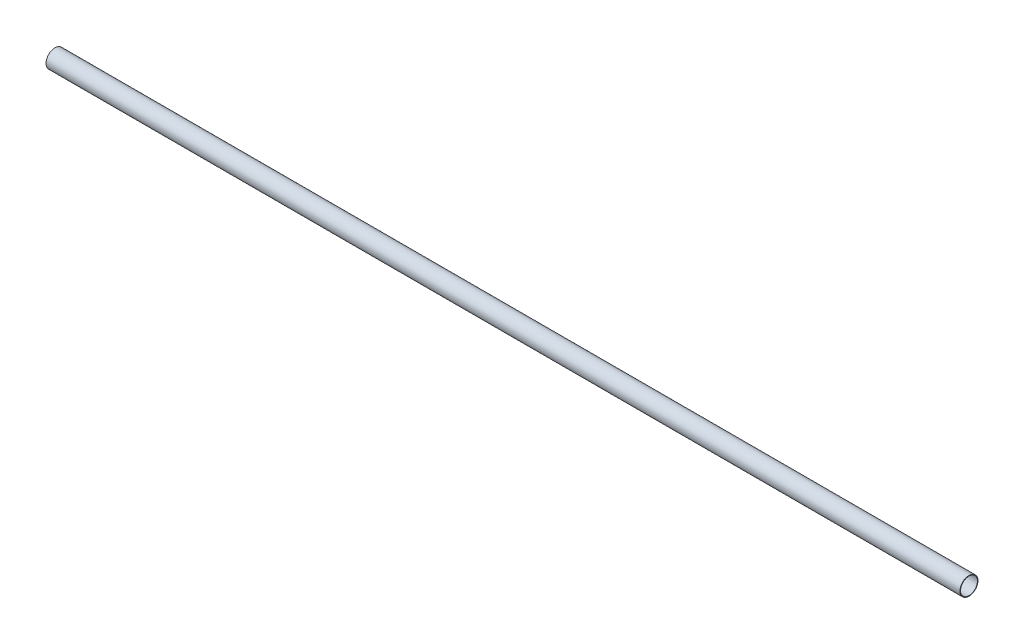
ISO-10303-21;
HEADER;
FILE_DESCRIPTION(('STEP AP214'),'2;1');
FILE_NAME('part.step','',(''),(''),'','','');
FILE_SCHEMA(('AUTOMOTIVE_DESIGN { 1 0 10303 214 1 1 1 1 }'));
ENDSEC;
DATA;
#1=APPLICATION_CONTEXT('core data for automotive mechanical design processes');
#2=APPLICATION_PROTOCOL_DEFINITION('international standard','automotive_design',2000,#1);
#3=PRODUCT_CONTEXT('',#1,'mechanical');
#4=PRODUCT('Part','Part','',(#3));
#5=PRODUCT_RELATED_PRODUCT_CATEGORY('part','',(#4));
#6=PRODUCT_DEFINITION_FORMATION('','',#4);
#7=PRODUCT_DEFINITION_CONTEXT('part definition',#1,'design');
#8=PRODUCT_DEFINITION('design','',#6,#7);
#9=PRODUCT_DEFINITION_SHAPE('','',#8);
#10=(LENGTH_UNIT() NAMED_UNIT(*) SI_UNIT(.MILLI.,.METRE.));
#11=(NAMED_UNIT(*) PLANE_ANGLE_UNIT() SI_UNIT($,.RADIAN.));
#12=(NAMED_UNIT(*) SI_UNIT($,.STERADIAN.) SOLID_ANGLE_UNIT());
#13=UNCERTAINTY_MEASURE_WITH_UNIT(LENGTH_MEASURE(1.E-05),#10,'distance_accuracy_value','');
#14=(GEOMETRIC_REPRESENTATION_CONTEXT(3) GLOBAL_UNCERTAINTY_ASSIGNED_CONTEXT((#13)) GLOBAL_UNIT_ASSIGNED_CONTEXT((#10,
#11,#12)) REPRESENTATION_CONTEXT('',''));
#15=CARTESIAN_POINT('',(0.,0.,0.));
#16=DIRECTION('',(0.,0.,1.));
#17=DIRECTION('',(1.,0.,0.));
#18=AXIS2_PLACEMENT_3D('',#15,#16,#17);
#19=CARTESIAN_POINT('',(723.9,0.,0.));
#20=DIRECTION('',(1.,0.,0.));
#21=DIRECTION('',(0.,0.,-1.));
#22=AXIS2_PLACEMENT_3D('',#19,#20,#21);
#23=PLANE('',#22);
#24=CARTESIAN_POINT('',(723.9,0.,0.));
#25=DIRECTION('',(1.,0.,0.));
#26=DIRECTION('',(0.,0.,-1.));
#27=AXIS2_PLACEMENT_3D('',#24,#25,#26);
#28=CIRCLE('',#27,14.2875);
#29=CARTESIAN_POINT('',(723.9,0.,-14.2875));
#30=VERTEX_POINT('',#29);
#31=EDGE_CURVE('E10',#30,#30,#28,.T.);
#32=ORIENTED_EDGE('',*,*,#31,.T.);
#33=EDGE_LOOP('',(#32));
#34=FACE_BOUND('',#33,.T.);
#35=CARTESIAN_POINT('',(723.9,0.,0.));
#36=DIRECTION('',(1.,0.,0.));
#37=DIRECTION('',(0.,0.,-1.));
#38=AXIS2_PLACEMENT_3D('',#35,#36,#37);
#39=CIRCLE('',#38,13.3985);
#40=CARTESIAN_POINT('',(723.9,0.,-13.3985));
#41=VERTEX_POINT('',#40);
#42=EDGE_CURVE('E46',#41,#41,#39,.T.);
#43=ORIENTED_EDGE('',*,*,#42,.F.);
#44=EDGE_LOOP('',(#43));
#45=FACE_BOUND('',#44,.T.);
#46=ADVANCED_FACE('F35',(#34,#45),#23,.T.);
#47=CARTESIAN_POINT('',(-723.9,0.,0.));
#48=DIRECTION('',(1.,0.,0.));
#49=DIRECTION('',(0.,0.,-1.));
#50=AXIS2_PLACEMENT_3D('',#47,#48,#49);
#51=PLANE('',#50);
#52=CARTESIAN_POINT('',(-723.9,0.,0.));
#53=DIRECTION('',(1.,0.,0.));
#54=DIRECTION('',(0.,0.,-1.));
#55=AXIS2_PLACEMENT_3D('',#52,#53,#54);
#56=CIRCLE('',#55,14.2875);
#57=CARTESIAN_POINT('',(-723.9,0.,-14.2875));
#58=VERTEX_POINT('',#57);
#59=EDGE_CURVE('E39',#58,#58,#56,.T.);
#60=ORIENTED_EDGE('',*,*,#59,.F.);
#61=EDGE_LOOP('',(#60));
#62=FACE_BOUND('',#61,.T.);
#63=CARTESIAN_POINT('',(-723.9,0.,0.));
#64=DIRECTION('',(1.,0.,0.));
#65=DIRECTION('',(0.,0.,-1.));
#66=AXIS2_PLACEMENT_3D('',#63,#64,#65);
#67=CIRCLE('',#66,13.3985);
#68=CARTESIAN_POINT('',(-723.9,0.,-13.3985));
#69=VERTEX_POINT('',#68);
#70=EDGE_CURVE('E48',#69,#69,#67,.T.);
#71=ORIENTED_EDGE('',*,*,#70,.T.);
#72=EDGE_LOOP('',(#71));
#73=FACE_BOUND('',#72,.T.);
#74=ADVANCED_FACE('F58',(#62,#73),#51,.F.);
#75=CARTESIAN_POINT('',(723.9,0.,0.));
#76=DIRECTION('',(-1.,0.,0.));
#77=DIRECTION('',(0.,0.,1.));
#78=AXIS2_PLACEMENT_3D('',#75,#76,#77);
#79=CYLINDRICAL_SURFACE('',#78,14.2875);
#80=ORIENTED_EDGE('',*,*,#31,.F.);
#81=EDGE_LOOP('',(#80));
#82=FACE_BOUND('',#81,.T.);
#83=ORIENTED_EDGE('',*,*,#59,.T.);
#84=EDGE_LOOP('',(#83));
#85=FACE_BOUND('',#84,.T.);
#86=ADVANCED_FACE('F37',(#82,#85),#79,.T.);
#87=CARTESIAN_POINT('',(723.9,0.,0.));
#88=DIRECTION('',(-1.,0.,0.));
#89=DIRECTION('',(0.,0.,1.));
#90=AXIS2_PLACEMENT_3D('',#87,#88,#89);
#91=CYLINDRICAL_SURFACE('',#90,13.3985);
#92=ORIENTED_EDGE('',*,*,#42,.T.);
#93=EDGE_LOOP('',(#92));
#94=FACE_BOUND('',#93,.T.);
#95=ORIENTED_EDGE('',*,*,#70,.F.);
#96=EDGE_LOOP('',(#95));
#97=FACE_BOUND('',#96,.T.);
#98=ADVANCED_FACE('F54',(#94,#97),#91,.F.);
#99=CLOSED_SHELL('',(#46,#74,#86,#98));
#100=MANIFOLD_SOLID_BREP('B2',#99);
#101=ADVANCED_BREP_SHAPE_REPRESENTATION('',(#18,#100),#14);
#102=SHAPE_DEFINITION_REPRESENTATION(#9,#101);
ENDSEC;
END-ISO-10303-21;
